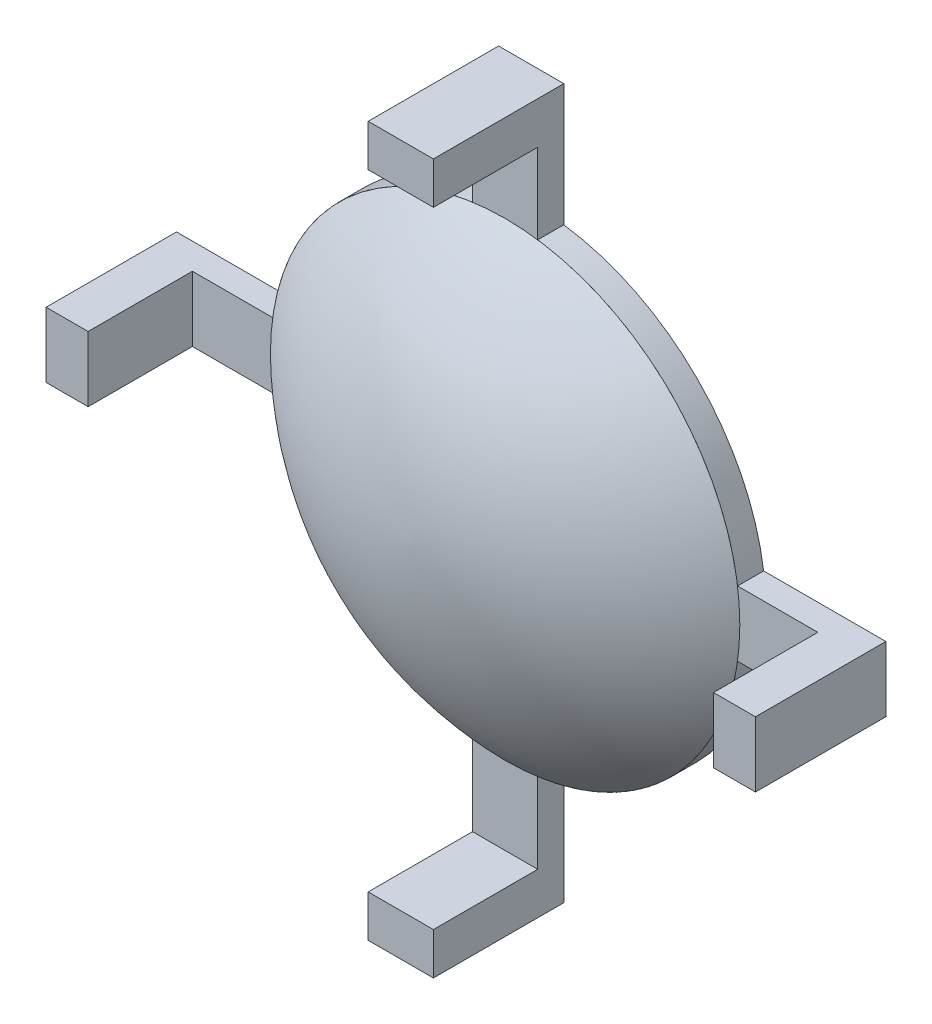
ISO-10303-21;
HEADER;
FILE_DESCRIPTION(('STEP AP214'),'2;1');
FILE_NAME('part.step','',(''),(''),'','','');
FILE_SCHEMA(('AUTOMOTIVE_DESIGN { 1 0 10303 214 1 1 1 1 }'));
ENDSEC;
DATA;
#1=APPLICATION_CONTEXT('core data for automotive mechanical design processes');
#2=APPLICATION_PROTOCOL_DEFINITION('international standard','automotive_design',2000,#1);
#3=PRODUCT_CONTEXT('',#1,'mechanical');
#4=PRODUCT('Part','Part','',(#3));
#5=PRODUCT_RELATED_PRODUCT_CATEGORY('part','',(#4));
#6=PRODUCT_DEFINITION_FORMATION('','',#4);
#7=PRODUCT_DEFINITION_CONTEXT('part definition',#1,'design');
#8=PRODUCT_DEFINITION('design','',#6,#7);
#9=PRODUCT_DEFINITION_SHAPE('','',#8);
#10=(LENGTH_UNIT() NAMED_UNIT(*) SI_UNIT(.MILLI.,.METRE.));
#11=(NAMED_UNIT(*) PLANE_ANGLE_UNIT() SI_UNIT($,.RADIAN.));
#12=(NAMED_UNIT(*) SI_UNIT($,.STERADIAN.) SOLID_ANGLE_UNIT());
#13=UNCERTAINTY_MEASURE_WITH_UNIT(LENGTH_MEASURE(1.E-05),#10,'distance_accuracy_value','');
#14=(GEOMETRIC_REPRESENTATION_CONTEXT(3) GLOBAL_UNCERTAINTY_ASSIGNED_CONTEXT((#13)) GLOBAL_UNIT_ASSIGNED_CONTEXT((#10,
#11,#12)) REPRESENTATION_CONTEXT('',''));
#15=CARTESIAN_POINT('',(0.,0.,0.));
#16=DIRECTION('',(0.,0.,1.));
#17=DIRECTION('',(1.,0.,0.));
#18=AXIS2_PLACEMENT_3D('',#15,#16,#17);
#19=CARTESIAN_POINT('',(0.,0.,1.));
#20=DIRECTION('',(0.,0.,-1.));
#21=DIRECTION('',(-1.,0.,0.));
#22=AXIS2_PLACEMENT_3D('',#19,#20,#21);
#23=PLANE('',#22);
#24=CARTESIAN_POINT('',(-0.000156815590799178,0.,1.));
#25=DIRECTION('',(0.,0.,-1.));
#26=DIRECTION('',(-1.,0.,0.));
#27=AXIS2_PLACEMENT_3D('',#24,#25,#26);
#28=CIRCLE('',#27,9.);
#29=CARTESIAN_POINT('',(-9.0001568155908,0.,1.));
#30=VERTEX_POINT('',#29);
#31=EDGE_CURVE('E13',#30,#30,#28,.T.);
#32=ORIENTED_EDGE('',*,*,#31,.T.);
#33=EDGE_LOOP('',(#32));
#34=FACE_BOUND('',#33,.T.);
#35=ADVANCED_FACE('F104',(#34),#23,.T.);
#36=CARTESIAN_POINT('',(0.318543083228573,0.,-8.87116191604712));
#37=DIRECTION('',(0.,-1.,0.));
#38=DIRECTION('',(-1.,0.,0.));
#39=AXIS2_PLACEMENT_3D('',#36,#37,#38);
#40=CIRCLE('',#39,13.5749035126249);
#41=TRIMMED_CURVE('',#40,(PARAMETER_VALUE(-1.54731703042916)),
(PARAMETER_VALUE(1.54731703042916)),.T.,.PARAMETER.);
#42=CARTESIAN_POINT('',(-0.000156815590799178,0.,-8.87116191604712));
#43=DIRECTION('',(0.,0.,-1.));
#44=AXIS1_PLACEMENT('',#42,#43);
#45=SURFACE_OF_REVOLUTION('',#41,#44);
#46=CARTESIAN_POINT('',(-0.000156815590799178,0.,4.7));
#47=VERTEX_POINT('',#46);
#48=VERTEX_LOOP('',#47);
#49=FACE_BOUND('',#48,.T.);
#50=ORIENTED_EDGE('',*,*,#31,.F.);
#51=EDGE_LOOP('',(#50));
#52=FACE_BOUND('',#51,.T.);
#53=ADVANCED_FACE('F112',(#49,#52),#45,.T.);
#54=CLOSED_SHELL('',(#35,#53));
#55=MANIFOLD_SOLID_BREP('B2',#54);
#56=CARTESIAN_POINT('',(0.,0.,1.));
#57=DIRECTION('',(0.,0.,1.));
#58=DIRECTION('',(1.,0.,0.));
#59=AXIS2_PLACEMENT_3D('',#56,#57,#58);
#60=PLANE('',#59);
#61=DIRECTION('',(0.,1.,0.));
#62=VECTOR('',#61,1.);
#63=CARTESIAN_POINT('',(-1.25000000000014,-13.6,1.));
#64=LINE('',#63,#62);
#65=CARTESIAN_POINT('',(-1.25000000000013,-11.9906023516351,1.));
#66=VERTEX_POINT('',#65);
#67=CARTESIAN_POINT('',(-1.25000000000009,-8.91277173498793,1.));
#68=VERTEX_POINT('',#67);
#69=EDGE_CURVE('E311',#66,#68,#64,.T.);
#70=ORIENTED_EDGE('',*,*,#69,.F.);
#71=DIRECTION('',(-1.,0.,0.));
#72=VECTOR('',#71,1.);
#73=CARTESIAN_POINT('',(-1.25000000000012,-11.9906023516351,1.));
#74=LINE('',#73,#72);
#75=CARTESIAN_POINT('',(1.24999999999988,-11.9906023516351,1.));
#76=VERTEX_POINT('',#75);
#77=EDGE_CURVE('E300',#76,#66,#74,.T.);
#78=ORIENTED_EDGE('',*,*,#77,.F.);
#79=DIRECTION('',(0.,1.,0.));
#80=VECTOR('',#79,1.);
#81=CARTESIAN_POINT('',(1.24999999999986,-13.6,1.));
#82=LINE('',#81,#80);
#83=CARTESIAN_POINT('',(1.24999999999991,-8.91277173498796,1.));
#84=VERTEX_POINT('',#83);
#85=EDGE_CURVE('E308',#76,#84,#82,.T.);
#86=ORIENTED_EDGE('',*,*,#85,.T.);
#87=CARTESIAN_POINT('',(0.,0.,1.));
#88=DIRECTION('',(0.,0.,1.));
#89=DIRECTION('',(1.,0.,0.));
#90=AXIS2_PLACEMENT_3D('',#87,#88,#89);
#91=CIRCLE('',#90,9.);
#92=CARTESIAN_POINT('',(8.91277173498794,-1.25,1.));
#93=VERTEX_POINT('',#92);
#94=EDGE_CURVE('E353',#84,#93,#91,.T.);
#95=ORIENTED_EDGE('',*,*,#94,.T.);
#96=DIRECTION('',(1.,0.,0.));
#97=VECTOR('',#96,1.);
#98=CARTESIAN_POINT('',(0.,-1.25,1.));
#99=LINE('',#98,#97);
#100=CARTESIAN_POINT('',(11.9906023516351,-1.25,1.));
#101=VERTEX_POINT('',#100);
#102=EDGE_CURVE('E389',#93,#101,#99,.T.);
#103=ORIENTED_EDGE('',*,*,#102,.T.);
#104=DIRECTION('',(0.,-1.,0.));
#105=VECTOR('',#104,1.);
#106=CARTESIAN_POINT('',(11.9906023516351,-1.25000000000008,1.));
#107=LINE('',#106,#105);
#108=CARTESIAN_POINT('',(11.9906023516351,1.25,1.));
#109=VERTEX_POINT('',#108);
#110=EDGE_CURVE('E158',#109,#101,#107,.T.);
#111=ORIENTED_EDGE('',*,*,#110,.F.);
#112=DIRECTION('',(1.,0.,0.));
#113=VECTOR('',#112,1.);
#114=CARTESIAN_POINT('',(0.,1.25,1.));
#115=LINE('',#114,#113);
#116=CARTESIAN_POINT('',(8.91277173498794,1.25,1.));
#117=VERTEX_POINT('',#116);
#118=EDGE_CURVE('E384',#117,#109,#115,.T.);
#119=ORIENTED_EDGE('',*,*,#118,.F.);
#120=CARTESIAN_POINT('',(1.25000000000009,8.91277173498793,1.));
#121=VERTEX_POINT('',#120);
#122=EDGE_CURVE('E356',#117,#121,#91,.T.);
#123=ORIENTED_EDGE('',*,*,#122,.T.);
#124=CARTESIAN_POINT('',(1.25000000000004,11.9906023516351,1.));
#125=VERTEX_POINT('',#124);
#126=EDGE_CURVE('E320',#121,#125,#82,.T.);
#127=ORIENTED_EDGE('',*,*,#126,.T.);
#128=DIRECTION('',(1.,0.,0.));
#129=VECTOR('',#128,1.);
#130=CARTESIAN_POINT('',(1.25000000000004,11.9906023516351,1.));
#131=LINE('',#130,#129);
#132=CARTESIAN_POINT('',(-1.24999999999996,11.9906023516351,1.));
#133=VERTEX_POINT('',#132);
#134=EDGE_CURVE('E453',#133,#125,#131,.T.);
#135=ORIENTED_EDGE('',*,*,#134,.F.);
#136=CARTESIAN_POINT('',(-1.24999999999991,8.91277173498796,1.));
#137=VERTEX_POINT('',#136);
#138=EDGE_CURVE('E319',#137,#133,#64,.T.);
#139=ORIENTED_EDGE('',*,*,#138,.F.);
#140=CARTESIAN_POINT('',(-8.91277173498794,1.25,1.));
#141=VERTEX_POINT('',#140);
#142=EDGE_CURVE('E357',#137,#141,#91,.T.);
#143=ORIENTED_EDGE('',*,*,#142,.T.);
#144=DIRECTION('',(1.,0.,0.));
#145=VECTOR('',#144,1.);
#146=CARTESIAN_POINT('',(0.,1.25,1.));
#147=LINE('',#146,#145);
#148=CARTESIAN_POINT('',(-11.9906023516351,1.25,1.));
#149=VERTEX_POINT('',#148);
#150=EDGE_CURVE('E414',#149,#141,#147,.T.);
#151=ORIENTED_EDGE('',*,*,#150,.F.);
#152=DIRECTION('',(0.,1.,0.));
#153=VECTOR('',#152,1.);
#154=CARTESIAN_POINT('',(-11.9906023516351,1.25,1.));
#155=LINE('',#154,#153);
#156=CARTESIAN_POINT('',(-11.9906023516351,-1.25,1.));
#157=VERTEX_POINT('',#156);
#158=EDGE_CURVE('E455',#157,#149,#155,.T.);
#159=ORIENTED_EDGE('',*,*,#158,.F.);
#160=DIRECTION('',(1.,0.,0.));
#161=VECTOR('',#160,1.);
#162=CARTESIAN_POINT('',(0.,-1.25,1.));
#163=LINE('',#162,#161);
#164=CARTESIAN_POINT('',(-8.91277173498794,-1.25,1.));
#165=VERTEX_POINT('',#164);
#166=EDGE_CURVE('E409',#157,#165,#163,.T.);
#167=ORIENTED_EDGE('',*,*,#166,.T.);
#168=EDGE_CURVE('E355',#165,#68,#91,.T.);
#169=ORIENTED_EDGE('',*,*,#168,.T.);
#170=EDGE_LOOP('',(#70,#78,#86,#95,#103,#111,#119,#123,#127,#135,#139,#143,#151,#159,#167,#169));
#171=FACE_BOUND('',#170,.T.);
#172=ADVANCED_FACE('F133',(#171),#60,.T.);
#173=CARTESIAN_POINT('',(0.,1.25,1.));
#174=DIRECTION('',(0.,1.,0.));
#175=DIRECTION('',(-1.,0.,0.));
#176=AXIS2_PLACEMENT_3D('',#173,#174,#175);
#177=PLANE('',#176);
#178=DIRECTION('',(1.,0.,0.));
#179=VECTOR('',#178,1.);
#180=CARTESIAN_POINT('',(0.,1.25,0.));
#181=LINE('',#180,#179);
#182=CARTESIAN_POINT('',(-13.6,1.25,0.));
#183=VERTEX_POINT('',#182);
#184=CARTESIAN_POINT('',(-8.91277173498794,1.25,0.));
#185=VERTEX_POINT('',#184);
#186=EDGE_CURVE('E397',#183,#185,#181,.T.);
#187=ORIENTED_EDGE('',*,*,#186,.F.);
#188=DIRECTION('',(0.,0.,-1.));
#189=VECTOR('',#188,1.);
#190=CARTESIAN_POINT('',(-13.6,1.25,1.));
#191=LINE('',#190,#189);
#192=CARTESIAN_POINT('',(-13.6,1.25,5.));
#193=VERTEX_POINT('',#192);
#194=EDGE_CURVE('E142',#193,#183,#191,.T.);
#195=ORIENTED_EDGE('',*,*,#194,.F.);
#196=DIRECTION('',(-1.,0.,0.));
#197=VECTOR('',#196,1.);
#198=CARTESIAN_POINT('',(-13.6,1.25,5.));
#199=LINE('',#198,#197);
#200=CARTESIAN_POINT('',(-11.9906023516351,1.25,5.));
#201=VERTEX_POINT('',#200);
#202=EDGE_CURVE('E472',#201,#193,#199,.T.);
#203=ORIENTED_EDGE('',*,*,#202,.F.);
#204=DIRECTION('',(0.,0.,-1.));
#205=VECTOR('',#204,1.);
#206=CARTESIAN_POINT('',(-11.9906023516351,1.25,5.));
#207=LINE('',#206,#205);
#208=EDGE_CURVE('E475',#201,#149,#207,.T.);
#209=ORIENTED_EDGE('',*,*,#208,.T.);
#210=ORIENTED_EDGE('',*,*,#150,.T.);
#211=DIRECTION('',(0.,0.,-1.));
#212=VECTOR('',#211,1.);
#213=CARTESIAN_POINT('',(-8.91277173498794,1.25,1.));
#214=LINE('',#213,#212);
#215=EDGE_CURVE('E102',#141,#185,#214,.T.);
#216=ORIENTED_EDGE('',*,*,#215,.T.);
#217=EDGE_LOOP('',(#187,#195,#203,#209,#210,#216));
#218=FACE_BOUND('',#217,.T.);
#219=ADVANCED_FACE('F528',(#218),#177,.T.);
#220=CARTESIAN_POINT('',(-13.6,0.,1.));
#221=DIRECTION('',(-1.,0.,0.));
#222=DIRECTION('',(0.,0.,1.));
#223=AXIS2_PLACEMENT_3D('',#220,#221,#222);
#224=PLANE('',#223);
#225=DIRECTION('',(0.,1.,0.));
#226=VECTOR('',#225,1.);
#227=CARTESIAN_POINT('',(-13.6,0.,0.));
#228=LINE('',#227,#226);
#229=CARTESIAN_POINT('',(-13.6,-1.25,0.));
#230=VERTEX_POINT('',#229);
#231=EDGE_CURVE('E400',#230,#183,#228,.T.);
#232=ORIENTED_EDGE('',*,*,#231,.F.);
#233=DIRECTION('',(0.,0.,-1.));
#234=VECTOR('',#233,1.);
#235=CARTESIAN_POINT('',(-13.6,-1.25,1.));
#236=LINE('',#235,#234);
#237=CARTESIAN_POINT('',(-13.6,-1.25,5.));
#238=VERTEX_POINT('',#237);
#239=EDGE_CURVE('E417',#238,#230,#236,.T.);
#240=ORIENTED_EDGE('',*,*,#239,.F.);
#241=DIRECTION('',(0.,-1.,0.));
#242=VECTOR('',#241,1.);
#243=CARTESIAN_POINT('',(-13.6,1.25,5.));
#244=LINE('',#243,#242);
#245=EDGE_CURVE('E465',#193,#238,#244,.T.);
#246=ORIENTED_EDGE('',*,*,#245,.F.);
#247=ORIENTED_EDGE('',*,*,#194,.T.);
#248=EDGE_LOOP('',(#232,#240,#246,#247));
#249=FACE_BOUND('',#248,.T.);
#250=ADVANCED_FACE('F534',(#249),#224,.T.);
#251=CARTESIAN_POINT('',(0.,-1.25,1.));
#252=DIRECTION('',(0.,1.,0.));
#253=DIRECTION('',(-1.,0.,0.));
#254=AXIS2_PLACEMENT_3D('',#251,#252,#253);
#255=PLANE('',#254);
#256=DIRECTION('',(1.,0.,0.));
#257=VECTOR('',#256,1.);
#258=CARTESIAN_POINT('',(0.,-1.25,0.));
#259=LINE('',#258,#257);
#260=CARTESIAN_POINT('',(-8.91277173498794,-1.25,0.));
#261=VERTEX_POINT('',#260);
#262=EDGE_CURVE('E406',#230,#261,#259,.T.);
#263=ORIENTED_EDGE('',*,*,#262,.T.);
#264=DIRECTION('',(0.,0.,-1.));
#265=VECTOR('',#264,1.);
#266=CARTESIAN_POINT('',(-8.91277173498794,-1.25,1.));
#267=LINE('',#266,#265);
#268=EDGE_CURVE('E415',#165,#261,#267,.T.);
#269=ORIENTED_EDGE('',*,*,#268,.F.);
#270=ORIENTED_EDGE('',*,*,#166,.F.);
#271=DIRECTION('',(0.,0.,-1.));
#272=VECTOR('',#271,1.);
#273=CARTESIAN_POINT('',(-11.9906023516351,-1.25,5.));
#274=LINE('',#273,#272);
#275=CARTESIAN_POINT('',(-11.9906023516351,-1.25,5.));
#276=VERTEX_POINT('',#275);
#277=EDGE_CURVE('E480',#276,#157,#274,.T.);
#278=ORIENTED_EDGE('',*,*,#277,.F.);
#279=DIRECTION('',(1.,0.,0.));
#280=VECTOR('',#279,1.);
#281=CARTESIAN_POINT('',(-13.6,-1.25,5.));
#282=LINE('',#281,#280);
#283=EDGE_CURVE('E468',#238,#276,#282,.T.);
#284=ORIENTED_EDGE('',*,*,#283,.F.);
#285=ORIENTED_EDGE('',*,*,#239,.T.);
#286=EDGE_LOOP('',(#263,#269,#270,#278,#284,#285));
#287=FACE_BOUND('',#286,.T.);
#288=ADVANCED_FACE('F490',(#287),#255,.F.);
#289=CARTESIAN_POINT('',(0.,0.,0.));
#290=DIRECTION('',(0.,0.,1.));
#291=DIRECTION('',(1.,0.,0.));
#292=AXIS2_PLACEMENT_3D('',#289,#290,#291);
#293=PLANE('',#292);
#294=ORIENTED_EDGE('',*,*,#186,.T.);
#295=CARTESIAN_POINT('',(0.,0.,0.));
#296=DIRECTION('',(0.,0.,1.));
#297=DIRECTION('',(1.,0.,0.));
#298=AXIS2_PLACEMENT_3D('',#295,#296,#297);
#299=CIRCLE('',#298,9.);
#300=CARTESIAN_POINT('',(-1.24999999999991,8.91277173498796,0.));
#301=VERTEX_POINT('',#300);
#302=EDGE_CURVE('E363',#301,#185,#299,.T.);
#303=ORIENTED_EDGE('',*,*,#302,.F.);
#304=DIRECTION('',(0.,1.,0.));
#305=VECTOR('',#304,1.);
#306=CARTESIAN_POINT('',(-1.25000000000014,-13.6,0.));
#307=LINE('',#306,#305);
#308=CARTESIAN_POINT('',(-1.24999999999986,13.6,0.));
#309=VERTEX_POINT('',#308);
#310=EDGE_CURVE('E337',#301,#309,#307,.T.);
#311=ORIENTED_EDGE('',*,*,#310,.T.);
#312=DIRECTION('',(-1.,0.,0.));
#313=VECTOR('',#312,1.);
#314=CARTESIAN_POINT('',(1.25000000000014,13.6,0.));
#315=LINE('',#314,#313);
#316=CARTESIAN_POINT('',(1.25000000000014,13.6,0.));
#317=VERTEX_POINT('',#316);
#318=EDGE_CURVE('E333',#317,#309,#315,.T.);
#319=ORIENTED_EDGE('',*,*,#318,.F.);
#320=DIRECTION('',(0.,1.,0.));
#321=VECTOR('',#320,1.);
#322=CARTESIAN_POINT('',(1.24999999999986,-13.6,0.));
#323=LINE('',#322,#321);
#324=CARTESIAN_POINT('',(1.25000000000009,8.91277173498793,0.));
#325=VERTEX_POINT('',#324);
#326=EDGE_CURVE('E334',#325,#317,#323,.T.);
#327=ORIENTED_EDGE('',*,*,#326,.F.);
#328=CARTESIAN_POINT('',(8.91277173498794,1.25,0.));
#329=VERTEX_POINT('',#328);
#330=EDGE_CURVE('E362',#329,#325,#299,.T.);
#331=ORIENTED_EDGE('',*,*,#330,.F.);
#332=DIRECTION('',(1.,0.,0.));
#333=VECTOR('',#332,1.);
#334=CARTESIAN_POINT('',(0.,1.25,0.));
#335=LINE('',#334,#333);
#336=CARTESIAN_POINT('',(13.6,1.25,0.));
#337=VERTEX_POINT('',#336);
#338=EDGE_CURVE('E381',#329,#337,#335,.T.);
#339=ORIENTED_EDGE('',*,*,#338,.T.);
#340=DIRECTION('',(0.,1.,0.));
#341=VECTOR('',#340,1.);
#342=CARTESIAN_POINT('',(13.6,0.,0.));
#343=LINE('',#342,#341);
#344=CARTESIAN_POINT('',(13.6,-1.25,0.));
#345=VERTEX_POINT('',#344);
#346=EDGE_CURVE('E375',#345,#337,#343,.T.);
#347=ORIENTED_EDGE('',*,*,#346,.F.);
#348=DIRECTION('',(1.,0.,0.));
#349=VECTOR('',#348,1.);
#350=CARTESIAN_POINT('',(0.,-1.25,0.));
#351=LINE('',#350,#349);
#352=CARTESIAN_POINT('',(8.91277173498794,-1.25,0.));
#353=VERTEX_POINT('',#352);
#354=EDGE_CURVE('E370',#353,#345,#351,.T.);
#355=ORIENTED_EDGE('',*,*,#354,.F.);
#356=CARTESIAN_POINT('',(1.24999999999991,-8.91277173498796,0.));
#357=VERTEX_POINT('',#356);
#358=EDGE_CURVE('E358',#357,#353,#299,.T.);
#359=ORIENTED_EDGE('',*,*,#358,.F.);
#360=CARTESIAN_POINT('',(1.24999999999986,-13.6,0.));
#361=VERTEX_POINT('',#360);
#362=EDGE_CURVE('E331',#361,#357,#323,.T.);
#363=ORIENTED_EDGE('',*,*,#362,.F.);
#364=DIRECTION('',(-1.,0.,0.));
#365=VECTOR('',#364,1.);
#366=CARTESIAN_POINT('',(1.24999999999986,-13.6,0.));
#367=LINE('',#366,#365);
#368=CARTESIAN_POINT('',(-1.25000000000014,-13.6,0.));
#369=VERTEX_POINT('',#368);
#370=EDGE_CURVE('E325',#361,#369,#367,.T.);
#371=ORIENTED_EDGE('',*,*,#370,.T.);
#372=CARTESIAN_POINT('',(-1.25000000000009,-8.91277173498793,0.));
#373=VERTEX_POINT('',#372);
#374=EDGE_CURVE('E338',#369,#373,#307,.T.);
#375=ORIENTED_EDGE('',*,*,#374,.T.);
#376=EDGE_CURVE('E361',#261,#373,#299,.T.);
#377=ORIENTED_EDGE('',*,*,#376,.F.);
#378=ORIENTED_EDGE('',*,*,#262,.F.);
#379=ORIENTED_EDGE('',*,*,#231,.T.);
#380=EDGE_LOOP('',(#294,#303,#311,#319,#327,#331,#339,#347,#355,#359,#363,#371,#375,#377,#378,#379));
#381=FACE_BOUND('',#380,.T.);
#382=ADVANCED_FACE('F504',(#381),#293,.F.);
#383=CARTESIAN_POINT('',(13.6,0.,1.));
#384=DIRECTION('',(-1.,0.,0.));
#385=DIRECTION('',(0.,0.,1.));
#386=AXIS2_PLACEMENT_3D('',#383,#384,#385);
#387=PLANE('',#386);
#388=ORIENTED_EDGE('',*,*,#346,.T.);
#389=DIRECTION('',(0.,0.,-1.));
#390=VECTOR('',#389,1.);
#391=CARTESIAN_POINT('',(13.6,1.25,1.));
#392=LINE('',#391,#390);
#393=CARTESIAN_POINT('',(13.6,1.24999999999991,5.));
#394=VERTEX_POINT('',#393);
#395=EDGE_CURVE('E392',#394,#337,#392,.T.);
#396=ORIENTED_EDGE('',*,*,#395,.F.);
#397=DIRECTION('',(0.,1.,0.));
#398=VECTOR('',#397,1.);
#399=CARTESIAN_POINT('',(13.6,-1.25000000000009,5.));
#400=LINE('',#399,#398);
#401=CARTESIAN_POINT('',(13.6,-1.25000000000009,5.));
#402=VERTEX_POINT('',#401);
#403=EDGE_CURVE('E443',#402,#394,#400,.T.);
#404=ORIENTED_EDGE('',*,*,#403,.F.);
#405=DIRECTION('',(0.,0.,-1.));
#406=VECTOR('',#405,1.);
#407=CARTESIAN_POINT('',(13.6,-1.25,1.));
#408=LINE('',#407,#406);
#409=EDGE_CURVE('E393',#402,#345,#408,.T.);
#410=ORIENTED_EDGE('',*,*,#409,.T.);
#411=EDGE_LOOP('',(#388,#396,#404,#410));
#412=FACE_BOUND('',#411,.T.);
#413=ADVANCED_FACE('F571',(#412),#387,.F.);
#414=CARTESIAN_POINT('',(0.,1.25,1.));
#415=DIRECTION('',(0.,1.,0.));
#416=DIRECTION('',(-1.,0.,0.));
#417=AXIS2_PLACEMENT_3D('',#414,#415,#416);
#418=PLANE('',#417);
#419=ORIENTED_EDGE('',*,*,#338,.F.);
#420=DIRECTION('',(0.,0.,-1.));
#421=VECTOR('',#420,1.);
#422=CARTESIAN_POINT('',(8.91277173498794,1.25,1.));
#423=LINE('',#422,#421);
#424=EDGE_CURVE('E390',#117,#329,#423,.T.);
#425=ORIENTED_EDGE('',*,*,#424,.F.);
#426=ORIENTED_EDGE('',*,*,#118,.T.);
#427=DIRECTION('',(0.,0.,-1.));
#428=VECTOR('',#427,1.);
#429=CARTESIAN_POINT('',(11.9906023516351,1.24999999999992,5.));
#430=LINE('',#429,#428);
#431=CARTESIAN_POINT('',(11.9906023516351,1.24999999999992,5.));
#432=VERTEX_POINT('',#431);
#433=EDGE_CURVE('E312',#432,#109,#430,.T.);
#434=ORIENTED_EDGE('',*,*,#433,.F.);
#435=DIRECTION('',(-1.,0.,0.));
#436=VECTOR('',#435,1.);
#437=CARTESIAN_POINT('',(13.6,1.24999999999991,5.));
#438=LINE('',#437,#436);
#439=EDGE_CURVE('E441',#394,#432,#438,.T.);
#440=ORIENTED_EDGE('',*,*,#439,.F.);
#441=ORIENTED_EDGE('',*,*,#395,.T.);
#442=EDGE_LOOP('',(#419,#425,#426,#434,#440,#441));
#443=FACE_BOUND('',#442,.T.);
#444=ADVANCED_FACE('F423',(#443),#418,.T.);
#445=CARTESIAN_POINT('',(0.,-1.25,1.));
#446=DIRECTION('',(0.,1.,0.));
#447=DIRECTION('',(-1.,0.,0.));
#448=AXIS2_PLACEMENT_3D('',#445,#446,#447);
#449=PLANE('',#448);
#450=ORIENTED_EDGE('',*,*,#354,.T.);
#451=ORIENTED_EDGE('',*,*,#409,.F.);
#452=DIRECTION('',(1.,0.,0.));
#453=VECTOR('',#452,1.);
#454=CARTESIAN_POINT('',(13.6,-1.25000000000009,5.));
#455=LINE('',#454,#453);
#456=CARTESIAN_POINT('',(11.9906023516351,-1.25000000000008,5.));
#457=VERTEX_POINT('',#456);
#458=EDGE_CURVE('E439',#457,#402,#455,.T.);
#459=ORIENTED_EDGE('',*,*,#458,.F.);
#460=DIRECTION('',(0.,0.,-1.));
#461=VECTOR('',#460,1.);
#462=CARTESIAN_POINT('',(11.9906023516351,-1.25000000000008,5.));
#463=LINE('',#462,#461);
#464=EDGE_CURVE('E431',#457,#101,#463,.T.);
#465=ORIENTED_EDGE('',*,*,#464,.T.);
#466=ORIENTED_EDGE('',*,*,#102,.F.);
#467=DIRECTION('',(0.,0.,-1.));
#468=VECTOR('',#467,1.);
#469=CARTESIAN_POINT('',(8.91277173498794,-1.25,1.));
#470=LINE('',#469,#468);
#471=EDGE_CURVE('E327',#93,#353,#470,.T.);
#472=ORIENTED_EDGE('',*,*,#471,.T.);
#473=EDGE_LOOP('',(#450,#451,#459,#465,#466,#472));
#474=FACE_BOUND('',#473,.T.);
#475=ADVANCED_FACE('F574',(#474),#449,.F.);
#476=CARTESIAN_POINT('',(1.24999999999986,-13.6,1.));
#477=DIRECTION('',(-1.,0.,0.));
#478=DIRECTION('',(0.,-1.,0.));
#479=AXIS2_PLACEMENT_3D('',#476,#477,#478);
#480=PLANE('',#479);
#481=DIRECTION('',(0.,0.,-1.));
#482=VECTOR('',#481,1.);
#483=CARTESIAN_POINT('',(1.25000000000009,8.91277173498793,1.));
#484=LINE('',#483,#482);
#485=EDGE_CURVE('E137',#325,#121,#484,.F.);
#486=ORIENTED_EDGE('',*,*,#485,.F.);
#487=ORIENTED_EDGE('',*,*,#326,.T.);
#488=DIRECTION('',(0.,0.,-1.));
#489=VECTOR('',#488,1.);
#490=CARTESIAN_POINT('',(1.25000000000014,13.6,1.));
#491=LINE('',#490,#489);
#492=CARTESIAN_POINT('',(1.25000000000005,13.6,5.));
#493=VERTEX_POINT('',#492);
#494=EDGE_CURVE('E349',#493,#317,#491,.T.);
#495=ORIENTED_EDGE('',*,*,#494,.F.);
#496=DIRECTION('',(0.,1.,0.));
#497=VECTOR('',#496,1.);
#498=CARTESIAN_POINT('',(1.25000000000005,13.6,5.));
#499=LINE('',#498,#497);
#500=CARTESIAN_POINT('',(1.25000000000004,11.9906023516351,5.));
#501=VERTEX_POINT('',#500);
#502=EDGE_CURVE('E456',#501,#493,#499,.T.);
#503=ORIENTED_EDGE('',*,*,#502,.F.);
#504=DIRECTION('',(0.,0.,-1.));
#505=VECTOR('',#504,1.);
#506=CARTESIAN_POINT('',(1.25000000000004,11.9906023516351,5.));
#507=LINE('',#506,#505);
#508=EDGE_CURVE('E449',#501,#125,#507,.T.);
#509=ORIENTED_EDGE('',*,*,#508,.T.);
#510=ORIENTED_EDGE('',*,*,#126,.F.);
#511=EDGE_LOOP('',(#486,#487,#495,#503,#509,#510));
#512=FACE_BOUND('',#511,.T.);
#513=ADVANCED_FACE('F502',(#512),#480,.F.);
#514=DIRECTION('',(0.,0.,-1.));
#515=VECTOR('',#514,1.);
#516=CARTESIAN_POINT('',(1.24999999999991,-8.91277173498796,1.));
#517=LINE('',#516,#515);
#518=EDGE_CURVE('E317',#84,#357,#517,.T.);
#519=ORIENTED_EDGE('',*,*,#518,.F.);
#520=ORIENTED_EDGE('',*,*,#85,.F.);
#521=DIRECTION('',(0.,0.,-1.));
#522=VECTOR('',#521,1.);
#523=CARTESIAN_POINT('',(1.24999999999988,-11.9906023516351,5.));
#524=LINE('',#523,#522);
#525=CARTESIAN_POINT('',(1.24999999999988,-11.9906023516351,5.));
#526=VERTEX_POINT('',#525);
#527=EDGE_CURVE('E297',#526,#76,#524,.T.);
#528=ORIENTED_EDGE('',*,*,#527,.F.);
#529=DIRECTION('',(0.,1.,0.));
#530=VECTOR('',#529,1.);
#531=CARTESIAN_POINT('',(1.24999999999986,-13.6,5.));
#532=LINE('',#531,#530);
#533=CARTESIAN_POINT('',(1.24999999999986,-13.6,5.));
#534=VERTEX_POINT('',#533);
#535=EDGE_CURVE('E547',#534,#526,#532,.T.);
#536=ORIENTED_EDGE('',*,*,#535,.F.);
#537=DIRECTION('',(0.,0.,-1.));
#538=VECTOR('',#537,1.);
#539=CARTESIAN_POINT('',(1.24999999999986,-13.6,1.));
#540=LINE('',#539,#538);
#541=EDGE_CURVE('E330',#534,#361,#540,.T.);
#542=ORIENTED_EDGE('',*,*,#541,.T.);
#543=ORIENTED_EDGE('',*,*,#362,.T.);
#544=EDGE_LOOP('',(#519,#520,#528,#536,#542,#543));
#545=FACE_BOUND('',#544,.T.);
#546=ADVANCED_FACE('F315',(#545),#480,.F.);
#547=CARTESIAN_POINT('',(0.,0.,1.));
#548=DIRECTION('',(0.,0.,-1.));
#549=DIRECTION('',(-1.,0.,0.));
#550=AXIS2_PLACEMENT_3D('',#547,#548,#549);
#551=CYLINDRICAL_SURFACE('',#550,9.);
#552=ORIENTED_EDGE('',*,*,#424,.T.);
#553=ORIENTED_EDGE('',*,*,#330,.T.);
#554=ORIENTED_EDGE('',*,*,#485,.T.);
#555=ORIENTED_EDGE('',*,*,#122,.F.);
#556=EDGE_LOOP('',(#552,#553,#554,#555));
#557=FACE_BOUND('',#556,.T.);
#558=ADVANCED_FACE('F499',(#557),#551,.T.);
#559=ORIENTED_EDGE('',*,*,#358,.T.);
#560=ORIENTED_EDGE('',*,*,#471,.F.);
#561=ORIENTED_EDGE('',*,*,#94,.F.);
#562=ORIENTED_EDGE('',*,*,#518,.T.);
#563=EDGE_LOOP('',(#559,#560,#561,#562));
#564=FACE_BOUND('',#563,.T.);
#565=ADVANCED_FACE('F575',(#564),#551,.T.);
#566=CARTESIAN_POINT('',(1.25000000000014,13.6,1.));
#567=DIRECTION('',(0.,-1.,0.));
#568=DIRECTION('',(1.,0.,0.));
#569=AXIS2_PLACEMENT_3D('',#566,#567,#568);
#570=PLANE('',#569);
#571=ORIENTED_EDGE('',*,*,#318,.T.);
#572=DIRECTION('',(0.,0.,-1.));
#573=VECTOR('',#572,1.);
#574=CARTESIAN_POINT('',(-1.24999999999986,13.6,1.));
#575=LINE('',#574,#573);
#576=CARTESIAN_POINT('',(-1.24999999999995,13.6,5.));
#577=VERTEX_POINT('',#576);
#578=EDGE_CURVE('E346',#577,#309,#575,.T.);
#579=ORIENTED_EDGE('',*,*,#578,.F.);
#580=DIRECTION('',(-1.,0.,0.));
#581=VECTOR('',#580,1.);
#582=CARTESIAN_POINT('',(1.25000000000005,13.6,5.));
#583=LINE('',#582,#581);
#584=EDGE_CURVE('E460',#493,#577,#583,.T.);
#585=ORIENTED_EDGE('',*,*,#584,.F.);
#586=ORIENTED_EDGE('',*,*,#494,.T.);
#587=EDGE_LOOP('',(#571,#579,#585,#586));
#588=FACE_BOUND('',#587,.T.);
#589=ADVANCED_FACE('F508',(#588),#570,.F.);
#590=CARTESIAN_POINT('',(1.24999999999986,-13.6,1.));
#591=DIRECTION('',(0.,-1.,0.));
#592=DIRECTION('',(1.,0.,0.));
#593=AXIS2_PLACEMENT_3D('',#590,#591,#592);
#594=PLANE('',#593);
#595=ORIENTED_EDGE('',*,*,#370,.F.);
#596=ORIENTED_EDGE('',*,*,#541,.F.);
#597=DIRECTION('',(1.,0.,0.));
#598=VECTOR('',#597,1.);
#599=CARTESIAN_POINT('',(-1.25000000000014,-13.6,5.));
#600=LINE('',#599,#598);
#601=CARTESIAN_POINT('',(-1.25000000000014,-13.6,5.));
#602=VERTEX_POINT('',#601);
#603=EDGE_CURVE('E544',#602,#534,#600,.T.);
#604=ORIENTED_EDGE('',*,*,#603,.F.);
#605=DIRECTION('',(0.,0.,-1.));
#606=VECTOR('',#605,1.);
#607=CARTESIAN_POINT('',(-1.25000000000014,-13.6,1.));
#608=LINE('',#607,#606);
#609=EDGE_CURVE('E344',#602,#369,#608,.T.);
#610=ORIENTED_EDGE('',*,*,#609,.T.);
#611=EDGE_LOOP('',(#595,#596,#604,#610));
#612=FACE_BOUND('',#611,.T.);
#613=ADVANCED_FACE('F542',(#612),#594,.T.);
#614=CARTESIAN_POINT('',(-1.25000000000014,-13.6,1.));
#615=DIRECTION('',(-1.,0.,0.));
#616=DIRECTION('',(0.,-1.,0.));
#617=AXIS2_PLACEMENT_3D('',#614,#615,#616);
#618=PLANE('',#617);
#619=ORIENTED_EDGE('',*,*,#310,.F.);
#620=DIRECTION('',(0.,0.,-1.));
#621=VECTOR('',#620,1.);
#622=CARTESIAN_POINT('',(-1.24999999999991,8.91277173498796,1.));
#623=LINE('',#622,#621);
#624=EDGE_CURVE('E366',#301,#137,#623,.F.);
#625=ORIENTED_EDGE('',*,*,#624,.T.);
#626=ORIENTED_EDGE('',*,*,#138,.T.);
#627=DIRECTION('',(0.,0.,-1.));
#628=VECTOR('',#627,1.);
#629=CARTESIAN_POINT('',(-1.24999999999996,11.9906023516351,5.));
#630=LINE('',#629,#628);
#631=CARTESIAN_POINT('',(-1.24999999999996,11.9906023516351,5.));
#632=VERTEX_POINT('',#631);
#633=EDGE_CURVE('E438',#632,#133,#630,.T.);
#634=ORIENTED_EDGE('',*,*,#633,.F.);
#635=DIRECTION('',(0.,-1.,0.));
#636=VECTOR('',#635,1.);
#637=CARTESIAN_POINT('',(-1.24999999999995,13.6,5.));
#638=LINE('',#637,#636);
#639=EDGE_CURVE('E458',#577,#632,#638,.T.);
#640=ORIENTED_EDGE('',*,*,#639,.F.);
#641=ORIENTED_EDGE('',*,*,#578,.T.);
#642=EDGE_LOOP('',(#619,#625,#626,#634,#640,#641));
#643=FACE_BOUND('',#642,.T.);
#644=ADVANCED_FACE('F521',(#643),#618,.T.);
#645=ORIENTED_EDGE('',*,*,#609,.F.);
#646=DIRECTION('',(0.,-1.,0.));
#647=VECTOR('',#646,1.);
#648=CARTESIAN_POINT('',(-1.25000000000014,-13.6,5.));
#649=LINE('',#648,#647);
#650=CARTESIAN_POINT('',(-1.25000000000012,-11.9906023516351,5.));
#651=VERTEX_POINT('',#650);
#652=EDGE_CURVE('E313',#651,#602,#649,.T.);
#653=ORIENTED_EDGE('',*,*,#652,.F.);
#654=DIRECTION('',(0.,0.,-1.));
#655=VECTOR('',#654,1.);
#656=CARTESIAN_POINT('',(-1.25000000000012,-11.9906023516351,5.));
#657=LINE('',#656,#655);
#658=EDGE_CURVE('E150',#651,#66,#657,.T.);
#659=ORIENTED_EDGE('',*,*,#658,.T.);
#660=ORIENTED_EDGE('',*,*,#69,.T.);
#661=DIRECTION('',(0.,0.,-1.));
#662=VECTOR('',#661,1.);
#663=CARTESIAN_POINT('',(-1.25000000000009,-8.91277173498793,1.));
#664=LINE('',#663,#662);
#665=EDGE_CURVE('E352',#68,#373,#664,.T.);
#666=ORIENTED_EDGE('',*,*,#665,.T.);
#667=ORIENTED_EDGE('',*,*,#374,.F.);
#668=EDGE_LOOP('',(#645,#653,#659,#660,#666,#667));
#669=FACE_BOUND('',#668,.T.);
#670=ADVANCED_FACE('F537',(#669),#618,.T.);
#671=ORIENTED_EDGE('',*,*,#215,.F.);
#672=ORIENTED_EDGE('',*,*,#142,.F.);
#673=ORIENTED_EDGE('',*,*,#624,.F.);
#674=ORIENTED_EDGE('',*,*,#302,.T.);
#675=EDGE_LOOP('',(#671,#672,#673,#674));
#676=FACE_BOUND('',#675,.T.);
#677=ADVANCED_FACE('F135',(#676),#551,.T.);
#678=ORIENTED_EDGE('',*,*,#168,.F.);
#679=ORIENTED_EDGE('',*,*,#268,.T.);
#680=ORIENTED_EDGE('',*,*,#376,.T.);
#681=ORIENTED_EDGE('',*,*,#665,.F.);
#682=EDGE_LOOP('',(#678,#679,#680,#681));
#683=FACE_BOUND('',#682,.T.);
#684=ADVANCED_FACE('F494',(#683),#551,.T.);
#685=CARTESIAN_POINT('',(-11.9906023516351,1.25,5.));
#686=DIRECTION('',(-1.,0.,0.));
#687=DIRECTION('',(0.,0.,1.));
#688=AXIS2_PLACEMENT_3D('',#685,#686,#687);
#689=PLANE('',#688);
#690=ORIENTED_EDGE('',*,*,#158,.T.);
#691=ORIENTED_EDGE('',*,*,#208,.F.);
#692=DIRECTION('',(0.,1.,0.));
#693=VECTOR('',#692,1.);
#694=CARTESIAN_POINT('',(-11.9906023516351,1.25,5.));
#695=LINE('',#694,#693);
#696=EDGE_CURVE('E470',#276,#201,#695,.T.);
#697=ORIENTED_EDGE('',*,*,#696,.F.);
#698=ORIENTED_EDGE('',*,*,#277,.T.);
#699=EDGE_LOOP('',(#690,#691,#697,#698));
#700=FACE_BOUND('',#699,.T.);
#701=ADVANCED_FACE('F525',(#700),#689,.F.);
#702=CARTESIAN_POINT('',(0.,0.,5.));
#703=DIRECTION('',(0.,0.,1.));
#704=DIRECTION('',(1.,0.,0.));
#705=AXIS2_PLACEMENT_3D('',#702,#703,#704);
#706=PLANE('',#705);
#707=ORIENTED_EDGE('',*,*,#245,.T.);
#708=ORIENTED_EDGE('',*,*,#283,.T.);
#709=ORIENTED_EDGE('',*,*,#696,.T.);
#710=ORIENTED_EDGE('',*,*,#202,.T.);
#711=EDGE_LOOP('',(#707,#708,#709,#710));
#712=FACE_BOUND('',#711,.T.);
#713=ADVANCED_FACE('F531',(#712),#706,.T.);
#714=CARTESIAN_POINT('',(1.25000000000004,11.9906023516351,5.));
#715=DIRECTION('',(0.,1.,0.));
#716=DIRECTION('',(-1.,0.,0.));
#717=AXIS2_PLACEMENT_3D('',#714,#715,#716);
#718=PLANE('',#717);
#719=ORIENTED_EDGE('',*,*,#134,.T.);
#720=ORIENTED_EDGE('',*,*,#508,.F.);
#721=DIRECTION('',(1.,0.,0.));
#722=VECTOR('',#721,1.);
#723=CARTESIAN_POINT('',(1.25000000000004,11.9906023516351,5.));
#724=LINE('',#723,#722);
#725=EDGE_CURVE('E452',#632,#501,#724,.T.);
#726=ORIENTED_EDGE('',*,*,#725,.F.);
#727=ORIENTED_EDGE('',*,*,#633,.T.);
#728=EDGE_LOOP('',(#719,#720,#726,#727));
#729=FACE_BOUND('',#728,.T.);
#730=ADVANCED_FACE('F517',(#729),#718,.F.);
#731=CARTESIAN_POINT('',(0.,0.,5.));
#732=DIRECTION('',(0.,0.,-1.));
#733=DIRECTION('',(-1.,0.,0.));
#734=AXIS2_PLACEMENT_3D('',#731,#732,#733);
#735=PLANE('',#734);
#736=ORIENTED_EDGE('',*,*,#502,.T.);
#737=ORIENTED_EDGE('',*,*,#584,.T.);
#738=ORIENTED_EDGE('',*,*,#639,.T.);
#739=ORIENTED_EDGE('',*,*,#725,.T.);
#740=EDGE_LOOP('',(#736,#737,#738,#739));
#741=FACE_BOUND('',#740,.T.);
#742=ADVANCED_FACE('F512',(#741),#735,.F.);
#743=CARTESIAN_POINT('',(11.9906023516351,-1.25000000000008,5.));
#744=DIRECTION('',(1.,0.,0.));
#745=DIRECTION('',(0.,1.,0.));
#746=AXIS2_PLACEMENT_3D('',#743,#744,#745);
#747=PLANE('',#746);
#748=ORIENTED_EDGE('',*,*,#110,.T.);
#749=ORIENTED_EDGE('',*,*,#464,.F.);
#750=DIRECTION('',(0.,-1.,0.));
#751=VECTOR('',#750,1.);
#752=CARTESIAN_POINT('',(11.9906023516351,-1.25000000000008,5.));
#753=LINE('',#752,#751);
#754=EDGE_CURVE('E430',#432,#457,#753,.T.);
#755=ORIENTED_EDGE('',*,*,#754,.F.);
#756=ORIENTED_EDGE('',*,*,#433,.T.);
#757=EDGE_LOOP('',(#748,#749,#755,#756));
#758=FACE_BOUND('',#757,.T.);
#759=ADVANCED_FACE('F427',(#758),#747,.F.);
#760=CARTESIAN_POINT('',(0.,0.,5.));
#761=DIRECTION('',(0.,0.,-1.));
#762=DIRECTION('',(-1.,0.,0.));
#763=AXIS2_PLACEMENT_3D('',#760,#761,#762);
#764=PLANE('',#763);
#765=ORIENTED_EDGE('',*,*,#458,.T.);
#766=ORIENTED_EDGE('',*,*,#403,.T.);
#767=ORIENTED_EDGE('',*,*,#439,.T.);
#768=ORIENTED_EDGE('',*,*,#754,.T.);
#769=EDGE_LOOP('',(#765,#766,#767,#768));
#770=FACE_BOUND('',#769,.T.);
#771=ADVANCED_FACE('F557',(#770),#764,.F.);
#772=CARTESIAN_POINT('',(-1.25000000000012,-11.9906023516351,5.));
#773=DIRECTION('',(0.,-1.,0.));
#774=DIRECTION('',(1.,0.,0.));
#775=AXIS2_PLACEMENT_3D('',#772,#773,#774);
#776=PLANE('',#775);
#777=ORIENTED_EDGE('',*,*,#77,.T.);
#778=ORIENTED_EDGE('',*,*,#658,.F.);
#779=DIRECTION('',(-1.,0.,0.));
#780=VECTOR('',#779,1.);
#781=CARTESIAN_POINT('',(-1.25000000000012,-11.9906023516351,5.));
#782=LINE('',#781,#780);
#783=EDGE_CURVE('E302',#526,#651,#782,.T.);
#784=ORIENTED_EDGE('',*,*,#783,.F.);
#785=ORIENTED_EDGE('',*,*,#527,.T.);
#786=EDGE_LOOP('',(#777,#778,#784,#785));
#787=FACE_BOUND('',#786,.T.);
#788=ADVANCED_FACE('F299',(#787),#776,.F.);
#789=CARTESIAN_POINT('',(0.,0.,5.));
#790=DIRECTION('',(0.,0.,-1.));
#791=DIRECTION('',(-1.,0.,0.));
#792=AXIS2_PLACEMENT_3D('',#789,#790,#791);
#793=PLANE('',#792);
#794=ORIENTED_EDGE('',*,*,#652,.T.);
#795=ORIENTED_EDGE('',*,*,#603,.T.);
#796=ORIENTED_EDGE('',*,*,#535,.T.);
#797=ORIENTED_EDGE('',*,*,#783,.T.);
#798=EDGE_LOOP('',(#794,#795,#796,#797));
#799=FACE_BOUND('',#798,.T.);
#800=ADVANCED_FACE('F548',(#799),#793,.F.);
#801=CLOSED_SHELL('',(#172,#219,#250,#288,#382,#413,#444,#475,#513,#546,#558,#565,#589,#613,
#644,#670,#677,#684,#701,#713,#730,#742,#759,#771,#788,#800));
#802=MANIFOLD_SOLID_BREP('B7',#801);
#803=ADVANCED_BREP_SHAPE_REPRESENTATION('',(#18,#55,#802),#14);
#804=SHAPE_DEFINITION_REPRESENTATION(#9,#803);
ENDSEC;
END-ISO-10303-21;
